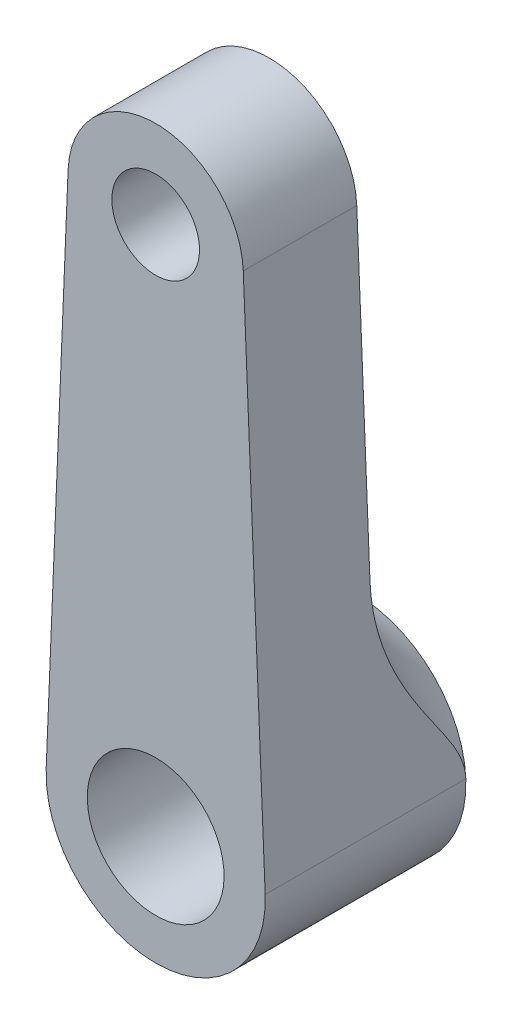
ISO-10303-21;
HEADER;
FILE_DESCRIPTION(('STEP AP214'),'2;1');
FILE_NAME('part.step','',(''),(''),'','','');
FILE_SCHEMA(('AUTOMOTIVE_DESIGN { 1 0 10303 214 1 1 1 1 }'));
ENDSEC;
DATA;
#1=APPLICATION_CONTEXT('core data for automotive mechanical design processes');
#2=APPLICATION_PROTOCOL_DEFINITION('international standard','automotive_design',2000,#1);
#3=PRODUCT_CONTEXT('',#1,'mechanical');
#4=PRODUCT('Part','Part','',(#3));
#5=PRODUCT_RELATED_PRODUCT_CATEGORY('part','',(#4));
#6=PRODUCT_DEFINITION_FORMATION('','',#4);
#7=PRODUCT_DEFINITION_CONTEXT('part definition',#1,'design');
#8=PRODUCT_DEFINITION('design','',#6,#7);
#9=PRODUCT_DEFINITION_SHAPE('','',#8);
#10=(LENGTH_UNIT() NAMED_UNIT(*) SI_UNIT(.MILLI.,.METRE.));
#11=(NAMED_UNIT(*) PLANE_ANGLE_UNIT() SI_UNIT($,.RADIAN.));
#12=(NAMED_UNIT(*) SI_UNIT($,.STERADIAN.) SOLID_ANGLE_UNIT());
#13=UNCERTAINTY_MEASURE_WITH_UNIT(LENGTH_MEASURE(1.E-05),#10,'distance_accuracy_value','');
#14=(GEOMETRIC_REPRESENTATION_CONTEXT(3) GLOBAL_UNCERTAINTY_ASSIGNED_CONTEXT((#13)) GLOBAL_UNIT_ASSIGNED_CONTEXT((#10,
#11,#12)) REPRESENTATION_CONTEXT('',''));
#15=CARTESIAN_POINT('',(0.,0.,0.));
#16=DIRECTION('',(0.,0.,1.));
#17=DIRECTION('',(1.,0.,0.));
#18=AXIS2_PLACEMENT_3D('',#15,#16,#17);
#19=CARTESIAN_POINT('',(0.,19.1928806338417,31.75));
#20=DIRECTION('',(0.,0.,-1.));
#21=DIRECTION('',(0.,1.,0.));
#22=AXIS2_PLACEMENT_3D('',#19,#20,#21);
#23=PLANE('',#22);
#24=DIRECTION('',(0.0413564808296899,-0.99914445476787,0.));
#25=VECTOR('',#24,1.);
#26=CARTESIAN_POINT('',(3.17228364388799,19.3241874604759,31.75));
#27=LINE('',#26,#25);
#28=CARTESIAN_POINT('',(3.17228364388799,19.3241874604759,31.75));
#29=VERTEX_POINT('',#28);
#30=CARTESIAN_POINT('',(3.64906657186918,7.80543612904241,31.75));
#31=VERTEX_POINT('',#30);
#32=EDGE_CURVE('E82',#29,#31,#27,.T.);
#33=ORIENTED_EDGE('',*,*,#32,.T.);
#34=CARTESIAN_POINT('',(0.,0.,31.75));
#35=DIRECTION('',(0.,0.,-1.));
#36=DIRECTION('',(0.,1.,0.));
#37=AXIS2_PLACEMENT_3D('',#34,#35,#36);
#38=CIRCLE('',#37,8.61629386746376);
#39=CARTESIAN_POINT('',(-3.64906657186918,7.80543612904241,31.75));
#40=VERTEX_POINT('',#39);
#41=EDGE_CURVE('E59',#31,#40,#38,.F.);
#42=ORIENTED_EDGE('',*,*,#41,.T.);
#43=DIRECTION('',(0.04135648082969,0.99914445476787,0.));
#44=VECTOR('',#43,1.);
#45=CARTESIAN_POINT('',(-3.17228364388799,19.3241874604759,31.75));
#46=LINE('',#45,#44);
#47=CARTESIAN_POINT('',(-3.17228364388799,19.3241874604759,31.75));
#48=VERTEX_POINT('',#47);
#49=EDGE_CURVE('E88',#40,#48,#46,.T.);
#50=ORIENTED_EDGE('',*,*,#49,.T.);
#51=CARTESIAN_POINT('',(0.,19.1928806338417,31.75));
#52=DIRECTION('',(0.,0.,-1.));
#53=DIRECTION('',(0.,1.,0.));
#54=AXIS2_PLACEMENT_3D('',#51,#52,#53);
#55=CIRCLE('',#54,3.175);
#56=EDGE_CURVE('E89',#48,#29,#55,.T.);
#57=ORIENTED_EDGE('',*,*,#56,.T.);
#58=EDGE_LOOP('',(#33,#42,#50,#57));
#59=FACE_BOUND('',#58,.T.);
#60=CARTESIAN_POINT('',(0.,19.1928806338417,31.75));
#61=DIRECTION('',(0.,0.,-1.));
#62=DIRECTION('',(0.,1.,0.));
#63=AXIS2_PLACEMENT_3D('',#60,#61,#62);
#64=CIRCLE('',#63,1.5875);
#65=CARTESIAN_POINT('',(0.,20.7803806338417,31.75));
#66=VERTEX_POINT('',#65);
#67=EDGE_CURVE('E154',#66,#66,#64,.T.);
#68=ORIENTED_EDGE('',*,*,#67,.F.);
#69=EDGE_LOOP('',(#68));
#70=FACE_BOUND('',#69,.T.);
#71=ADVANCED_FACE('F33',(#59,#70),#23,.T.);
#72=CARTESIAN_POINT('',(0.,19.1928806338417,35.86));
#73=DIRECTION('',(0.,0.,-1.));
#74=DIRECTION('',(0.,1.,0.));
#75=AXIS2_PLACEMENT_3D('',#72,#73,#74);
#76=PLANE('',#75);
#77=CARTESIAN_POINT('',(0.,19.1928806338417,35.86));
#78=DIRECTION('',(0.,0.,-1.));
#79=DIRECTION('',(0.,1.,0.));
#80=AXIS2_PLACEMENT_3D('',#77,#78,#79);
#81=CIRCLE('',#80,3.175);
#82=CARTESIAN_POINT('',(-3.17228364388799,19.3241874604759,35.86));
#83=VERTEX_POINT('',#82);
#84=CARTESIAN_POINT('',(3.17228364388799,19.3241874604759,35.86));
#85=VERTEX_POINT('',#84);
#86=EDGE_CURVE('E100',#83,#85,#81,.T.);
#87=ORIENTED_EDGE('',*,*,#86,.F.);
#88=DIRECTION('',(0.04135648082969,0.99914445476787,0.));
#89=VECTOR('',#88,1.);
#90=CARTESIAN_POINT('',(-3.17228364388799,19.3241874604759,35.86));
#91=LINE('',#90,#89);
#92=CARTESIAN_POINT('',(-3.96535455485998,0.164133533292832,35.86));
#93=VERTEX_POINT('',#92);
#94=EDGE_CURVE('E96',#93,#83,#91,.T.);
#95=ORIENTED_EDGE('',*,*,#94,.F.);
#96=CARTESIAN_POINT('',(0.,0.,35.86));
#97=DIRECTION('',(0.,0.,-1.));
#98=DIRECTION('',(0.,1.,0.));
#99=AXIS2_PLACEMENT_3D('',#96,#97,#98);
#100=CIRCLE('',#99,3.96875);
#101=CARTESIAN_POINT('',(3.96535455485998,0.164133533292833,35.86));
#102=VERTEX_POINT('',#101);
#103=EDGE_CURVE('E145',#102,#93,#100,.T.);
#104=ORIENTED_EDGE('',*,*,#103,.F.);
#105=DIRECTION('',(0.0413564808296899,-0.99914445476787,0.));
#106=VECTOR('',#105,1.);
#107=CARTESIAN_POINT('',(3.17228364388799,19.3241874604759,35.86));
#108=LINE('',#107,#106);
#109=EDGE_CURVE('E149',#85,#102,#108,.T.);
#110=ORIENTED_EDGE('',*,*,#109,.F.);
#111=EDGE_LOOP('',(#87,#95,#104,#110));
#112=FACE_BOUND('',#111,.T.);
#113=CARTESIAN_POINT('',(0.,0.,35.86));
#114=DIRECTION('',(0.,0.,-1.));
#115=DIRECTION('',(0.,1.,0.));
#116=AXIS2_PLACEMENT_3D('',#113,#114,#115);
#117=CIRCLE('',#116,2.4765);
#118=CARTESIAN_POINT('',(0.,2.4765,35.86));
#119=VERTEX_POINT('',#118);
#120=EDGE_CURVE('E150',#119,#119,#117,.T.);
#121=ORIENTED_EDGE('',*,*,#120,.T.);
#122=EDGE_LOOP('',(#121));
#123=FACE_BOUND('',#122,.T.);
#124=CARTESIAN_POINT('',(0.,19.1928806338417,35.86));
#125=DIRECTION('',(0.,0.,-1.));
#126=DIRECTION('',(0.,1.,0.));
#127=AXIS2_PLACEMENT_3D('',#124,#125,#126);
#128=CIRCLE('',#127,1.5875);
#129=CARTESIAN_POINT('',(0.,20.7803806338417,35.86));
#130=VERTEX_POINT('',#129);
#131=EDGE_CURVE('E171',#130,#130,#128,.T.);
#132=ORIENTED_EDGE('',*,*,#131,.T.);
#133=EDGE_LOOP('',(#132));
#134=FACE_BOUND('',#133,.T.);
#135=ADVANCED_FACE('F117',(#112,#123,#134),#76,.F.);
#136=CARTESIAN_POINT('',(0.,19.1928806338417,31.75));
#137=DIRECTION('',(0.,0.,1.));
#138=DIRECTION('',(0.,-1.,0.));
#139=AXIS2_PLACEMENT_3D('',#136,#137,#138);
#140=CYLINDRICAL_SURFACE('',#139,3.175);
#141=ORIENTED_EDGE('',*,*,#86,.T.);
#142=DIRECTION('',(0.,0.,1.));
#143=VECTOR('',#142,1.);
#144=CARTESIAN_POINT('',(3.17228364388799,19.3241874604759,31.75));
#145=LINE('',#144,#143);
#146=EDGE_CURVE('E86',#29,#85,#145,.T.);
#147=ORIENTED_EDGE('',*,*,#146,.F.);
#148=ORIENTED_EDGE('',*,*,#56,.F.);
#149=DIRECTION('',(0.,0.,1.));
#150=VECTOR('',#149,1.);
#151=CARTESIAN_POINT('',(-3.17228364388799,19.3241874604759,31.75));
#152=LINE('',#151,#150);
#153=EDGE_CURVE('E143',#48,#83,#152,.T.);
#154=ORIENTED_EDGE('',*,*,#153,.T.);
#155=EDGE_LOOP('',(#141,#147,#148,#154));
#156=FACE_BOUND('',#155,.T.);
#157=ADVANCED_FACE('F98',(#156),#140,.T.);
#158=CARTESIAN_POINT('',(3.17228364388799,19.3241874604759,31.75));
#159=DIRECTION('',(-0.99914445476787,-0.0413564808296899,0.));
#160=DIRECTION('',(0.0413564808296899,-0.99914445476787,0.));
#161=AXIS2_PLACEMENT_3D('',#158,#159,#160);
#162=PLANE('',#161);
#163=ORIENTED_EDGE('',*,*,#109,.T.);
#164=DIRECTION('',(0.,0.,1.));
#165=VECTOR('',#164,1.);
#166=CARTESIAN_POINT('',(3.96535455485998,0.164133533292833,31.75));
#167=LINE('',#166,#165);
#168=CARTESIAN_POINT('',(3.96535455485998,0.164133533292833,28.594));
#169=VERTEX_POINT('',#168);
#170=EDGE_CURVE('E101',#169,#102,#167,.T.);
#171=ORIENTED_EDGE('',*,*,#170,.F.);
#172=CARTESIAN_POINT('',(3.96535455485998,0.164133533292833,28.594));
#173=CARTESIAN_POINT('',(3.96289095250215,0.223652491028049,28.5939099695311));
#174=CARTESIAN_POINT('',(3.96043029497182,0.283100303733365,28.5973791249901));
#175=CARTESIAN_POINT('',(3.95554848475778,0.401041518912412,28.6106886506203));
#176=CARTESIAN_POINT('',(3.95312721053486,0.459537857691056,28.6205025296307));
#177=CARTESIAN_POINT('',(3.94839733092222,0.573808532851935,28.6454471896462));
#178=CARTESIAN_POINT('',(3.94608742396283,0.629614314272653,28.6604377036311));
#179=CARTESIAN_POINT('',(3.94152335042913,0.739879227313021,28.694821787677));
#180=CARTESIAN_POINT('',(3.93926923021341,0.794337238941133,28.7142188917977));
#181=CARTESIAN_POINT('',(3.93372224485528,0.928348633287785,28.7669071061333));
#182=CARTESIAN_POINT('',(3.93046445081687,1.00705472198168,28.8023365575988));
#183=CARTESIAN_POINT('',(3.9240549087566,1.16190489972018,28.8784690999861));
#184=CARTESIAN_POINT('',(3.92090327364677,1.23804626088705,28.9191775957047));
#185=CARTESIAN_POINT('',(3.91467222770591,1.38858409375663,29.0042053117299));
#186=CARTESIAN_POINT('',(3.91159307727735,1.46297427431282,29.0485355609955));
#187=CARTESIAN_POINT('',(3.90549393838367,1.61032532261824,29.1394279941998));
#188=CARTESIAN_POINT('',(3.90247392735762,1.68328673542425,29.1859893026941));
#189=CARTESIAN_POINT('',(3.89638387054252,1.83041836688686,29.2818538911439));
#190=CARTESIAN_POINT('',(3.89331491867933,1.90456215703879,29.331197531822));
#191=CARTESIAN_POINT('',(3.88719824450491,2.05233684580305,29.4306501681608));
#192=CARTESIAN_POINT('',(3.88415052307907,2.12596772302519,29.4807591954658));
#193=CARTESIAN_POINT('',(3.87502808764161,2.34635956001079,29.6312463165314));
#194=CARTESIAN_POINT('',(3.8689630171078,2.49288753990796,29.7319648931561));
#195=CARTESIAN_POINT('',(3.85679513530426,2.78685529021874,29.9310843152473));
#196=CARTESIAN_POINT('',(3.85069250084515,2.93429078900798,30.0294914120404));
#197=CARTESIAN_POINT('',(3.8383796380556,3.23176118135495,30.2223172202394));
#198=CARTESIAN_POINT('',(3.83216941160612,3.38179602946985,30.3167360012715));
#199=CARTESIAN_POINT('',(3.81960374764324,3.68537392626164,30.5000318747531));
#200=CARTESIAN_POINT('',(3.8132482114388,3.83891935924694,30.588905038168));
#201=CARTESIAN_POINT('',(3.80037634852898,4.14989481438398,30.7596342295477));
#202=CARTESIAN_POINT('',(3.79386000960966,4.30732513161624,30.8414897223519));
#203=CARTESIAN_POINT('',(3.78077228368668,4.62351569036618,30.9955454816693));
#204=CARTESIAN_POINT('',(3.77420376373785,4.78220666578878,31.0678874164367));
#205=CARTESIAN_POINT('',(3.76090656198585,5.1034580181258,31.2033668495819));
#206=CARTESIAN_POINT('',(3.7541779012283,5.2660178865924,31.2665055497583));
#207=CARTESIAN_POINT('',(3.74057796139075,5.594583185217,31.3824167662303));
#208=CARTESIAN_POINT('',(3.73370687076331,5.76058406248911,31.4352021202232));
#209=CARTESIAN_POINT('',(3.71983472140638,6.09572575800137,31.5294563257166));
#210=CARTESIAN_POINT('',(3.7128336878082,6.26486596908649,31.570927341576));
#211=CARTESIAN_POINT('',(3.69650279338612,6.65940927344565,31.6527212240673));
#212=CARTESIAN_POINT('',(3.68713318144255,6.88577272674094,31.6885785818682));
#213=CARTESIAN_POINT('',(3.67295872999772,7.22821783513409,31.7250841702732));
#214=CARTESIAN_POINT('',(3.66818977839877,7.34343246291555,31.734374990399));
#215=CARTESIAN_POINT('',(3.65863651215791,7.57423287914985,31.7468344417921));
#216=CARTESIAN_POINT('',(3.65385219247481,7.6898187893942,31.7500008015393));
#217=CARTESIAN_POINT('',(3.64906657186918,7.80543612904241,31.75));
#218=B_SPLINE_CURVE_WITH_KNOTS('',3,(#172,#173,#174,#175,#176,#177,#178,#179,#180,#181,#182,
#183,#184,#185,#186,#187,#188,#189,#190,#191,#192,#193,#194,#195,#196,#197,#198,#199,#200,#201,
#202,#203,#204,#205,#206,#207,#208,#209,#210,#211,#212,#213,#214,#215,#216,#217),.UNSPECIFIED.,
.F.,.F.,(4,2,2,2,2,2,2,2,2,2,2,2,2,2,2,2,2,2,2,2,2,2,4),(0.,0.178495446466349,0.356250391401078,
0.529524416539887,0.70293790011745,0.961743143966283,1.22081548149841,1.48070846306558,
1.74050028734702,2.00783666272644,2.27518412097905,2.80890970294151,3.34096992196769,
3.87302084867701,4.40544454740787,4.93790881218819,5.46122912926036,5.98448104753512,
6.50707999669959,7.0295789058975,7.71645182122566,8.06337206207001,8.41042094858472),.UNSPECIFIED.);
#219=EDGE_CURVE('E46',#169,#31,#218,.T.);
#220=ORIENTED_EDGE('',*,*,#219,.T.);
#221=ORIENTED_EDGE('',*,*,#32,.F.);
#222=ORIENTED_EDGE('',*,*,#146,.T.);
#223=EDGE_LOOP('',(#163,#171,#220,#221,#222));
#224=FACE_BOUND('',#223,.T.);
#225=ADVANCED_FACE('F84',(#224),#162,.F.);
#226=CARTESIAN_POINT('',(0.,0.,31.75));
#227=DIRECTION('',(0.,0.,1.));
#228=DIRECTION('',(0.,-1.,0.));
#229=AXIS2_PLACEMENT_3D('',#226,#227,#228);
#230=CYLINDRICAL_SURFACE('',#229,3.96875);
#231=CARTESIAN_POINT('',(0.,0.,28.594));
#232=DIRECTION('',(0.,0.,-1.));
#233=DIRECTION('',(0.,1.,0.));
#234=AXIS2_PLACEMENT_3D('',#231,#232,#233);
#235=CIRCLE('',#234,3.96875);
#236=CARTESIAN_POINT('',(-3.96535455485998,0.164133533292833,28.594));
#237=VERTEX_POINT('',#236);
#238=EDGE_CURVE('E160',#169,#237,#235,.T.);
#239=ORIENTED_EDGE('',*,*,#238,.F.);
#240=ORIENTED_EDGE('',*,*,#170,.T.);
#241=ORIENTED_EDGE('',*,*,#103,.T.);
#242=DIRECTION('',(0.,0.,1.));
#243=VECTOR('',#242,1.);
#244=CARTESIAN_POINT('',(-3.96535455485998,0.164133533292833,31.75));
#245=LINE('',#244,#243);
#246=EDGE_CURVE('E105',#237,#93,#245,.T.);
#247=ORIENTED_EDGE('',*,*,#246,.F.);
#248=EDGE_LOOP('',(#239,#240,#241,#247));
#249=FACE_BOUND('',#248,.T.);
#250=ADVANCED_FACE('F115',(#249),#230,.T.);
#251=CARTESIAN_POINT('',(-3.17228364388799,19.3241874604759,31.75));
#252=DIRECTION('',(0.99914445476787,-0.04135648082969,0.));
#253=DIRECTION('',(0.04135648082969,0.99914445476787,0.));
#254=AXIS2_PLACEMENT_3D('',#251,#252,#253);
#255=PLANE('',#254);
#256=ORIENTED_EDGE('',*,*,#94,.T.);
#257=ORIENTED_EDGE('',*,*,#153,.F.);
#258=ORIENTED_EDGE('',*,*,#49,.F.);
#259=CARTESIAN_POINT('',(-3.64906657186918,7.80543612904241,31.75));
#260=CARTESIAN_POINT('',(-3.65667854779166,7.62153596683827,31.7500264511643));
#261=CARTESIAN_POINT('',(-3.66428734352063,7.4377126359468,31.7419961965812));
#262=CARTESIAN_POINT('',(-3.67944260829361,7.07157174449095,31.7107815124422));
#263=CARTESIAN_POINT('',(-3.6869891426324,6.889252606449,31.6876157849122));
#264=CARTESIAN_POINT('',(-3.7018804060004,6.52948980941838,31.6274986727908));
#265=CARTESIAN_POINT('',(-3.70922648347415,6.35201357292672,31.5907401351134));
#266=CARTESIAN_POINT('',(-3.7237911784605,6.00014044593306,31.5044510591225));
#267=CARTESIAN_POINT('',(-3.73100974080757,5.82574488819274,31.4549151309739));
#268=CARTESIAN_POINT('',(-3.74928130467724,5.38431632961948,31.3132622546241));
#269=CARTESIAN_POINT('',(-3.76022453590746,5.11993530440732,31.2128141831717));
#270=CARTESIAN_POINT('',(-3.78168862864192,4.60137741935475,30.9881860077224));
#271=CARTESIAN_POINT('',(-3.79220916507297,4.34720841306152,30.8639880461929));
#272=CARTESIAN_POINT('',(-3.80770391958854,3.97286568027498,30.6634167431179));
#273=CARTESIAN_POINT('',(-3.81283485757615,3.84890570749122,30.5939700273144));
#274=CARTESIAN_POINT('',(-3.82299845741509,3.60336004654955,30.4511164955256));
#275=CARTESIAN_POINT('',(-3.82803116427467,3.48177327102264,30.3777115540566));
#276=CARTESIAN_POINT('',(-3.83801362242801,3.24060387002996,30.2276778125688));
#277=CARTESIAN_POINT('',(-3.84296336836151,3.12102137406432,30.1510488053518));
#278=CARTESIAN_POINT('',(-3.85279970460302,2.88338217909973,29.9954365313359));
#279=CARTESIAN_POINT('',(-3.8576862870519,2.76532566997201,29.9164529755383));
#280=CARTESIAN_POINT('',(-3.86720243013276,2.53542212403978,29.7608183163439));
#281=CARTESIAN_POINT('',(-3.87183359226967,2.42353639596541,29.684223994379));
#282=CARTESIAN_POINT('',(-3.88109781930411,2.19971897041389,29.5310561510307));
#283=CARTESIAN_POINT('',(-3.88573088439398,2.08778726828986,29.4544826358518));
#284=CARTESIAN_POINT('',(-3.89504857438908,1.86267821396322,29.3030361929231));
#285=CARTESIAN_POINT('',(-3.89973322820737,1.74950016324059,29.2281642992773));
#286=CARTESIAN_POINT('',(-3.90921723582313,1.52037298829359,29.0828140209819));
#287=CARTESIAN_POINT('',(-3.91401651921124,1.40442556511138,29.012333030654));
#288=CARTESIAN_POINT('',(-3.92131319622123,1.22814281023213,28.9141377739493));
#289=CARTESIAN_POINT('',(-3.92373067115564,1.16973825968058,28.8830074237531));
#290=CARTESIAN_POINT('',(-3.92862691398854,1.05144836224385,28.823724061219));
#291=CARTESIAN_POINT('',(-3.93110569683411,0.991562654247313,28.7955717839524));
#292=CARTESIAN_POINT('',(-3.93861614464334,0.810115342221125,28.7175066237273));
#293=CARTESIAN_POINT('',(-3.94376278538873,0.685776001487163,28.6733959764344));
#294=CARTESIAN_POINT('',(-3.95169877235059,0.494047952896485,28.6270073930911));
#295=CARTESIAN_POINT('',(-3.95438767181333,0.429085970306798,28.6148348808949));
#296=CARTESIAN_POINT('',(-3.95846539824186,0.330570872615047,28.6024422816735));
#297=CARTESIAN_POINT('',(-3.9598393532079,0.297377054913891,28.5992882834834));
#298=CARTESIAN_POINT('',(-3.96259360831792,0.230836124327519,28.5950623427057));
#299=CARTESIAN_POINT('',(-3.96397391203974,0.19748892500377,28.5939917703733));
#300=CARTESIAN_POINT('',(-3.96535455485998,0.164133533292833,28.594));
#301=B_SPLINE_CURVE_WITH_KNOTS('',3,(#259,#260,#261,#262,#263,#264,#265,#266,#267,#268,#269,
#270,#271,#272,#273,#274,#275,#276,#277,#278,#279,#280,#281,#282,#283,#284,#285,#286,#287,#288,
#289,#290,#291,#292,#293,#294,#295,#296,#297,#298,#299,#300),.UNSPECIFIED.,.F.,.F.,(4,2,2,2,2,2,
2,2,2,2,2,2,2,2,2,2,2,2,2,2,4),(0.,0.551884348239136,1.10308805141633,1.64675419944323,
2.19065005607965,3.03826985960334,3.88652951204131,4.31300849578738,4.73928725390135,
5.16559344929758,5.59195218699417,5.99896507711178,6.40605105083449,6.81337813765787,
7.22046115697755,7.41905802373488,7.61770379590803,8.01155728141296,8.20955776225694,
8.30961197083838,8.40973196218269),.UNSPECIFIED.);
#302=EDGE_CURVE('E11',#40,#237,#301,.T.);
#303=ORIENTED_EDGE('',*,*,#302,.T.);
#304=ORIENTED_EDGE('',*,*,#246,.T.);
#305=EDGE_LOOP('',(#256,#257,#258,#303,#304));
#306=FACE_BOUND('',#305,.T.);
#307=ADVANCED_FACE('F130',(#306),#255,.F.);
#308=CARTESIAN_POINT('',(0.,0.,31.75));
#309=DIRECTION('',(0.,0.,1.));
#310=DIRECTION('',(0.,-1.,0.));
#311=AXIS2_PLACEMENT_3D('',#308,#309,#310);
#312=CYLINDRICAL_SURFACE('',#311,2.4765);
#313=ORIENTED_EDGE('',*,*,#120,.F.);
#314=EDGE_LOOP('',(#313));
#315=FACE_BOUND('',#314,.T.);
#316=CARTESIAN_POINT('',(0.,0.,28.594));
#317=DIRECTION('',(0.,0.,-1.));
#318=DIRECTION('',(0.,1.,0.));
#319=AXIS2_PLACEMENT_3D('',#316,#317,#318);
#320=CIRCLE('',#319,2.4765);
#321=CARTESIAN_POINT('',(0.,2.4765,28.594));
#322=VERTEX_POINT('',#321);
#323=EDGE_CURVE('E169',#322,#322,#320,.T.);
#324=ORIENTED_EDGE('',*,*,#323,.T.);
#325=EDGE_LOOP('',(#324));
#326=FACE_BOUND('',#325,.T.);
#327=ADVANCED_FACE('F128',(#315,#326),#312,.F.);
#328=CARTESIAN_POINT('',(0.,19.1928806338417,31.75));
#329=DIRECTION('',(0.,0.,1.));
#330=DIRECTION('',(0.,-1.,0.));
#331=AXIS2_PLACEMENT_3D('',#328,#329,#330);
#332=CYLINDRICAL_SURFACE('',#331,1.5875);
#333=ORIENTED_EDGE('',*,*,#67,.T.);
#334=EDGE_LOOP('',(#333));
#335=FACE_BOUND('',#334,.T.);
#336=ORIENTED_EDGE('',*,*,#131,.F.);
#337=EDGE_LOOP('',(#336));
#338=FACE_BOUND('',#337,.T.);
#339=ADVANCED_FACE('F138',(#335,#338),#332,.F.);
#340=CARTESIAN_POINT('',(0.,0.,28.594));
#341=DIRECTION('',(0.,0.,-1.));
#342=DIRECTION('',(0.,1.,0.));
#343=AXIS2_PLACEMENT_3D('',#340,#341,#342);
#344=PLANE('',#343);
#345=ORIENTED_EDGE('',*,*,#238,.T.);
#346=EDGE_CURVE('E165',#237,#169,#235,.T.);
#347=ORIENTED_EDGE('',*,*,#346,.T.);
#348=EDGE_LOOP('',(#345,#347));
#349=FACE_BOUND('',#348,.T.);
#350=ORIENTED_EDGE('',*,*,#323,.F.);
#351=EDGE_LOOP('',(#350));
#352=FACE_BOUND('',#351,.T.);
#353=ADVANCED_FACE('F167',(#349,#352),#344,.T.);
#354=CARTESIAN_POINT('',(0.,0.,26.75));
#355=DIRECTION('',(0.,0.,-1.));
#356=DIRECTION('',(0.,1.,0.));
#357=AXIS2_PLACEMENT_3D('',#354,#355,#356);
#358=TOROIDAL_SURFACE('',#357,8.61629386746376,5.);
#359=ORIENTED_EDGE('',*,*,#302,.F.);
#360=ORIENTED_EDGE('',*,*,#41,.F.);
#361=ORIENTED_EDGE('',*,*,#219,.F.);
#362=ORIENTED_EDGE('',*,*,#346,.F.);
#363=EDGE_LOOP('',(#359,#360,#361,#362));
#364=FACE_BOUND('',#363,.T.);
#365=ADVANCED_FACE('F35',(#364),#358,.F.);
#366=CLOSED_SHELL('',(#71,#135,#157,#225,#250,#307,#327,#339,#353,#365));
#367=MANIFOLD_SOLID_BREP('B2',#366);
#368=ADVANCED_BREP_SHAPE_REPRESENTATION('',(#18,#367),#14);
#369=SHAPE_DEFINITION_REPRESENTATION(#9,#368);
ENDSEC;
END-ISO-10303-21;
